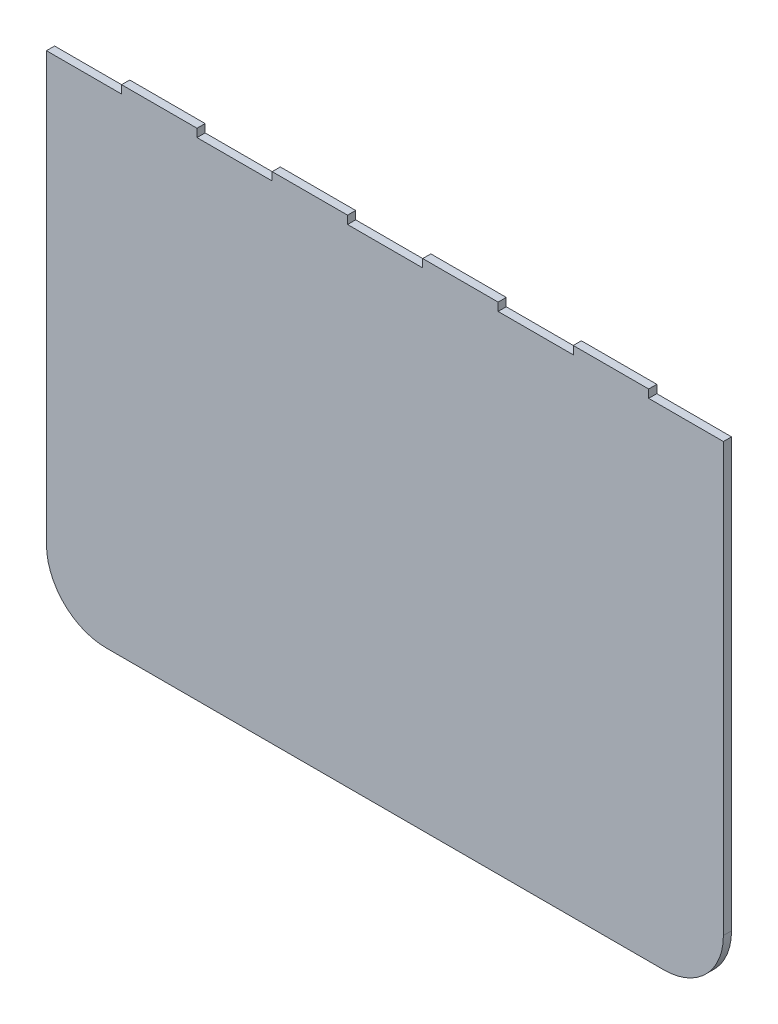
ISO-10303-21;
HEADER;
FILE_DESCRIPTION(('STEP AP214'),'2;1');
FILE_NAME('part.step','',(''),(''),'','','');
FILE_SCHEMA(('AUTOMOTIVE_DESIGN { 1 0 10303 214 1 1 1 1 }'));
ENDSEC;
DATA;
#1=APPLICATION_CONTEXT('core data for automotive mechanical design processes');
#2=APPLICATION_PROTOCOL_DEFINITION('international standard','automotive_design',2000,#1);
#3=PRODUCT_CONTEXT('',#1,'mechanical');
#4=PRODUCT('Part','Part','',(#3));
#5=PRODUCT_RELATED_PRODUCT_CATEGORY('part','',(#4));
#6=PRODUCT_DEFINITION_FORMATION('','',#4);
#7=PRODUCT_DEFINITION_CONTEXT('part definition',#1,'design');
#8=PRODUCT_DEFINITION('design','',#6,#7);
#9=PRODUCT_DEFINITION_SHAPE('','',#8);
#10=(LENGTH_UNIT() NAMED_UNIT(*) SI_UNIT(.MILLI.,.METRE.));
#11=(NAMED_UNIT(*) PLANE_ANGLE_UNIT() SI_UNIT($,.RADIAN.));
#12=(NAMED_UNIT(*) SI_UNIT($,.STERADIAN.) SOLID_ANGLE_UNIT());
#13=UNCERTAINTY_MEASURE_WITH_UNIT(LENGTH_MEASURE(1.E-05),#10,'distance_accuracy_value','');
#14=(GEOMETRIC_REPRESENTATION_CONTEXT(3) GLOBAL_UNCERTAINTY_ASSIGNED_CONTEXT((#13)) GLOBAL_UNIT_ASSIGNED_CONTEXT((#10,
#11,#12)) REPRESENTATION_CONTEXT('',''));
#15=CARTESIAN_POINT('',(0.,0.,0.));
#16=DIRECTION('',(0.,0.,1.));
#17=DIRECTION('',(1.,0.,0.));
#18=AXIS2_PLACEMENT_3D('',#15,#16,#17);
#19=CARTESIAN_POINT('',(0.,366.,-0.00999999999999959));
#20=DIRECTION('',(0.,-1.,0.));
#21=DIRECTION('',(0.,0.,-1.));
#22=AXIS2_PLACEMENT_3D('',#19,#20,#21);
#23=PLANE('',#22);
#24=DIRECTION('',(-1.,0.,0.));
#25=VECTOR('',#24,1.);
#26=CARTESIAN_POINT('',(0.,366.,0.));
#27=LINE('',#26,#25);
#28=CARTESIAN_POINT('',(444.8,366.,0.));
#29=VERTEX_POINT('',#28);
#30=CARTESIAN_POINT('',(389.1,366.,0.));
#31=VERTEX_POINT('',#30);
#32=EDGE_CURVE('E352',#29,#31,#27,.T.);
#33=ORIENTED_EDGE('',*,*,#32,.T.);
#34=DIRECTION('',(0.,0.,-1.));
#35=VECTOR('',#34,1.);
#36=CARTESIAN_POINT('',(389.1,366.,10.));
#37=LINE('',#36,#35);
#38=CARTESIAN_POINT('',(389.1,366.,6.));
#39=VERTEX_POINT('',#38);
#40=EDGE_CURVE('E246',#39,#31,#37,.T.);
#41=ORIENTED_EDGE('',*,*,#40,.F.);
#42=DIRECTION('',(-1.,0.,0.));
#43=VECTOR('',#42,1.);
#44=CARTESIAN_POINT('',(0.,366.,6.));
#45=LINE('',#44,#43);
#46=CARTESIAN_POINT('',(444.8,366.,6.));
#47=VERTEX_POINT('',#46);
#48=EDGE_CURVE('E347',#47,#39,#45,.T.);
#49=ORIENTED_EDGE('',*,*,#48,.F.);
#50=DIRECTION('',(0.,0.,-1.));
#51=VECTOR('',#50,1.);
#52=CARTESIAN_POINT('',(444.8,366.,10.));
#53=LINE('',#52,#51);
#54=EDGE_CURVE('E11',#47,#29,#53,.T.);
#55=ORIENTED_EDGE('',*,*,#54,.T.);
#56=EDGE_LOOP('',(#33,#41,#49,#55));
#57=FACE_BOUND('',#56,.T.);
#58=ADVANCED_FACE('F34',(#57),#23,.F.);
#59=CARTESIAN_POINT('',(333.6,366.,0.));
#60=VERTEX_POINT('',#59);
#61=CARTESIAN_POINT('',(277.9,366.,0.));
#62=VERTEX_POINT('',#61);
#63=EDGE_CURVE('E203',#60,#62,#27,.T.);
#64=ORIENTED_EDGE('',*,*,#63,.T.);
#65=DIRECTION('',(0.,0.,-1.));
#66=VECTOR('',#65,1.);
#67=CARTESIAN_POINT('',(277.9,366.,10.));
#68=LINE('',#67,#66);
#69=CARTESIAN_POINT('',(277.9,366.,6.));
#70=VERTEX_POINT('',#69);
#71=EDGE_CURVE('E231',#70,#62,#68,.T.);
#72=ORIENTED_EDGE('',*,*,#71,.F.);
#73=CARTESIAN_POINT('',(333.6,366.,6.));
#74=VERTEX_POINT('',#73);
#75=EDGE_CURVE('E351',#74,#70,#45,.T.);
#76=ORIENTED_EDGE('',*,*,#75,.F.);
#77=DIRECTION('',(0.,0.,-1.));
#78=VECTOR('',#77,1.);
#79=CARTESIAN_POINT('',(333.6,366.,10.));
#80=LINE('',#79,#78);
#81=EDGE_CURVE('E42',#74,#60,#80,.T.);
#82=ORIENTED_EDGE('',*,*,#81,.T.);
#83=EDGE_LOOP('',(#64,#72,#76,#82));
#84=FACE_BOUND('',#83,.T.);
#85=ADVANCED_FACE('F360',(#84),#23,.F.);
#86=CARTESIAN_POINT('',(111.2,366.,6.));
#87=VERTEX_POINT('',#86);
#88=CARTESIAN_POINT('',(55.4999999999999,366.,6.));
#89=VERTEX_POINT('',#88);
#90=EDGE_CURVE('E344',#87,#89,#45,.T.);
#91=ORIENTED_EDGE('',*,*,#90,.F.);
#92=DIRECTION('',(0.,0.,-1.));
#93=VECTOR('',#92,1.);
#94=CARTESIAN_POINT('',(111.2,366.,10.));
#95=LINE('',#94,#93);
#96=CARTESIAN_POINT('',(111.2,366.,0.));
#97=VERTEX_POINT('',#96);
#98=EDGE_CURVE('E219',#87,#97,#95,.T.);
#99=ORIENTED_EDGE('',*,*,#98,.T.);
#100=CARTESIAN_POINT('',(55.4999999999999,366.,0.));
#101=VERTEX_POINT('',#100);
#102=EDGE_CURVE('E37',#97,#101,#27,.T.);
#103=ORIENTED_EDGE('',*,*,#102,.T.);
#104=DIRECTION('',(0.,0.,-1.));
#105=VECTOR('',#104,1.);
#106=CARTESIAN_POINT('',(55.4999999999999,366.,10.));
#107=LINE('',#106,#105);
#108=EDGE_CURVE('E293',#89,#101,#107,.T.);
#109=ORIENTED_EDGE('',*,*,#108,.F.);
#110=EDGE_LOOP('',(#91,#99,#103,#109));
#111=FACE_BOUND('',#110,.T.);
#112=ADVANCED_FACE('F421',(#111),#23,.F.);
#113=CARTESIAN_POINT('',(222.4,366.,0.));
#114=VERTEX_POINT('',#113);
#115=CARTESIAN_POINT('',(166.7,366.,0.));
#116=VERTEX_POINT('',#115);
#117=EDGE_CURVE('E197',#114,#116,#27,.T.);
#118=ORIENTED_EDGE('',*,*,#117,.T.);
#119=DIRECTION('',(0.,0.,-1.));
#120=VECTOR('',#119,1.);
#121=CARTESIAN_POINT('',(166.7,366.,10.));
#122=LINE('',#121,#120);
#123=CARTESIAN_POINT('',(166.7,366.,6.));
#124=VERTEX_POINT('',#123);
#125=EDGE_CURVE('E182',#124,#116,#122,.T.);
#126=ORIENTED_EDGE('',*,*,#125,.F.);
#127=CARTESIAN_POINT('',(222.4,366.,6.));
#128=VERTEX_POINT('',#127);
#129=EDGE_CURVE('E346',#128,#124,#45,.T.);
#130=ORIENTED_EDGE('',*,*,#129,.F.);
#131=DIRECTION('',(0.,0.,-1.));
#132=VECTOR('',#131,1.);
#133=CARTESIAN_POINT('',(222.4,366.,10.));
#134=LINE('',#133,#132);
#135=EDGE_CURVE('E199',#128,#114,#134,.T.);
#136=ORIENTED_EDGE('',*,*,#135,.T.);
#137=EDGE_LOOP('',(#118,#126,#130,#136));
#138=FACE_BOUND('',#137,.T.);
#139=ADVANCED_FACE('F198',(#138),#23,.F.);
#140=CARTESIAN_POINT('',(0.,0.,6.));
#141=DIRECTION('',(1.,0.,0.));
#142=DIRECTION('',(0.,1.,0.));
#143=AXIS2_PLACEMENT_3D('',#140,#141,#142);
#144=PLANE('',#143);
#145=DIRECTION('',(0.,-1.,0.));
#146=VECTOR('',#145,1.);
#147=CARTESIAN_POINT('',(0.,0.,6.));
#148=LINE('',#147,#146);
#149=CARTESIAN_POINT('',(-1.11022302462516E-13,360.,6.));
#150=VERTEX_POINT('',#149);
#151=CARTESIAN_POINT('',(0.,44.,6.));
#152=VERTEX_POINT('',#151);
#153=EDGE_CURVE('E307',#150,#152,#148,.T.);
#154=ORIENTED_EDGE('',*,*,#153,.F.);
#155=DIRECTION('',(0.,0.,-1.));
#156=VECTOR('',#155,1.);
#157=CARTESIAN_POINT('',(-1.11022302462516E-13,360.,10.));
#158=LINE('',#157,#156);
#159=CARTESIAN_POINT('',(-1.11022302462516E-13,360.,0.));
#160=VERTEX_POINT('',#159);
#161=EDGE_CURVE('E294',#150,#160,#158,.T.);
#162=ORIENTED_EDGE('',*,*,#161,.T.);
#163=DIRECTION('',(0.,-1.,0.));
#164=VECTOR('',#163,1.);
#165=CARTESIAN_POINT('',(0.,0.,0.));
#166=LINE('',#165,#164);
#167=CARTESIAN_POINT('',(0.,44.,0.));
#168=VERTEX_POINT('',#167);
#169=EDGE_CURVE('E306',#160,#168,#166,.T.);
#170=ORIENTED_EDGE('',*,*,#169,.T.);
#171=DIRECTION('',(0.,0.,-1.));
#172=VECTOR('',#171,1.);
#173=CARTESIAN_POINT('',(0.,44.,6.));
#174=LINE('',#173,#172);
#175=EDGE_CURVE('E332',#168,#152,#174,.F.);
#176=ORIENTED_EDGE('',*,*,#175,.T.);
#177=EDGE_LOOP('',(#154,#162,#170,#176));
#178=FACE_BOUND('',#177,.T.);
#179=ADVANCED_FACE('F413',(#178),#144,.F.);
#180=CARTESIAN_POINT('',(44.,44.,6.));
#181=DIRECTION('',(0.,0.,-1.));
#182=DIRECTION('',(-1.,0.,0.));
#183=AXIS2_PLACEMENT_3D('',#180,#181,#182);
#184=CYLINDRICAL_SURFACE('',#183,44.);
#185=CARTESIAN_POINT('',(44.,44.,6.));
#186=DIRECTION('',(0.,0.,-1.));
#187=DIRECTION('',(-1.,0.,0.));
#188=AXIS2_PLACEMENT_3D('',#185,#186,#187);
#189=CIRCLE('',#188,44.);
#190=CARTESIAN_POINT('',(44.,0.,6.));
#191=VERTEX_POINT('',#190);
#192=EDGE_CURVE('E337',#152,#191,#189,.F.);
#193=ORIENTED_EDGE('',*,*,#192,.F.);
#194=ORIENTED_EDGE('',*,*,#175,.F.);
#195=CARTESIAN_POINT('',(44.,44.,0.));
#196=DIRECTION('',(0.,0.,-1.));
#197=DIRECTION('',(-1.,0.,0.));
#198=AXIS2_PLACEMENT_3D('',#195,#196,#197);
#199=CIRCLE('',#198,44.);
#200=CARTESIAN_POINT('',(44.,0.,0.));
#201=VERTEX_POINT('',#200);
#202=EDGE_CURVE('E329',#201,#168,#199,.T.);
#203=ORIENTED_EDGE('',*,*,#202,.F.);
#204=DIRECTION('',(0.,0.,-1.));
#205=VECTOR('',#204,1.);
#206=CARTESIAN_POINT('',(44.,0.,6.));
#207=LINE('',#206,#205);
#208=EDGE_CURVE('E324',#191,#201,#207,.T.);
#209=ORIENTED_EDGE('',*,*,#208,.F.);
#210=EDGE_LOOP('',(#193,#194,#203,#209));
#211=FACE_BOUND('',#210,.T.);
#212=ADVANCED_FACE('F406',(#211),#184,.T.);
#213=CARTESIAN_POINT('',(0.,0.,6.));
#214=DIRECTION('',(0.,1.,0.));
#215=DIRECTION('',(0.,0.,1.));
#216=AXIS2_PLACEMENT_3D('',#213,#214,#215);
#217=PLANE('',#216);
#218=DIRECTION('',(1.,0.,0.));
#219=VECTOR('',#218,1.);
#220=CARTESIAN_POINT('',(0.,0.,6.));
#221=LINE('',#220,#219);
#222=CARTESIAN_POINT('',(456.,0.,6.));
#223=VERTEX_POINT('',#222);
#224=EDGE_CURVE('E309',#191,#223,#221,.T.);
#225=ORIENTED_EDGE('',*,*,#224,.F.);
#226=ORIENTED_EDGE('',*,*,#208,.T.);
#227=DIRECTION('',(1.,0.,0.));
#228=VECTOR('',#227,1.);
#229=CARTESIAN_POINT('',(0.,0.,0.));
#230=LINE('',#229,#228);
#231=CARTESIAN_POINT('',(456.,0.,0.));
#232=VERTEX_POINT('',#231);
#233=EDGE_CURVE('E318',#201,#232,#230,.T.);
#234=ORIENTED_EDGE('',*,*,#233,.T.);
#235=DIRECTION('',(0.,0.,-1.));
#236=VECTOR('',#235,1.);
#237=CARTESIAN_POINT('',(456.,0.,6.));
#238=LINE('',#237,#236);
#239=EDGE_CURVE('E316',#232,#223,#238,.F.);
#240=ORIENTED_EDGE('',*,*,#239,.T.);
#241=EDGE_LOOP('',(#225,#226,#234,#240));
#242=FACE_BOUND('',#241,.T.);
#243=ADVANCED_FACE('F402',(#242),#217,.F.);
#244=CARTESIAN_POINT('',(456.,44.,6.));
#245=DIRECTION('',(0.,0.,-1.));
#246=DIRECTION('',(-1.,0.,0.));
#247=AXIS2_PLACEMENT_3D('',#244,#245,#246);
#248=CYLINDRICAL_SURFACE('',#247,44.);
#249=CARTESIAN_POINT('',(456.,44.,6.));
#250=DIRECTION('',(0.,0.,-1.));
#251=DIRECTION('',(-1.,0.,0.));
#252=AXIS2_PLACEMENT_3D('',#249,#250,#251);
#253=CIRCLE('',#252,44.);
#254=CARTESIAN_POINT('',(500.,44.,6.));
#255=VERTEX_POINT('',#254);
#256=EDGE_CURVE('E335',#223,#255,#253,.F.);
#257=ORIENTED_EDGE('',*,*,#256,.F.);
#258=ORIENTED_EDGE('',*,*,#239,.F.);
#259=CARTESIAN_POINT('',(456.,44.,0.));
#260=DIRECTION('',(0.,0.,-1.));
#261=DIRECTION('',(-1.,0.,0.));
#262=AXIS2_PLACEMENT_3D('',#259,#260,#261);
#263=CIRCLE('',#262,44.);
#264=CARTESIAN_POINT('',(500.,44.,0.));
#265=VERTEX_POINT('',#264);
#266=EDGE_CURVE('E327',#265,#232,#263,.T.);
#267=ORIENTED_EDGE('',*,*,#266,.F.);
#268=DIRECTION('',(0.,0.,-1.));
#269=VECTOR('',#268,1.);
#270=CARTESIAN_POINT('',(500.,44.,6.));
#271=LINE('',#270,#269);
#272=EDGE_CURVE('E339',#255,#265,#271,.T.);
#273=ORIENTED_EDGE('',*,*,#272,.F.);
#274=EDGE_LOOP('',(#257,#258,#267,#273));
#275=FACE_BOUND('',#274,.T.);
#276=ADVANCED_FACE('F397',(#275),#248,.T.);
#277=CARTESIAN_POINT('',(500.,0.,6.));
#278=DIRECTION('',(-1.,0.,0.));
#279=DIRECTION('',(0.,-1.,0.));
#280=AXIS2_PLACEMENT_3D('',#277,#278,#279);
#281=PLANE('',#280);
#282=DIRECTION('',(0.,1.,0.));
#283=VECTOR('',#282,1.);
#284=CARTESIAN_POINT('',(500.,0.,0.));
#285=LINE('',#284,#283);
#286=CARTESIAN_POINT('',(500.,360.,0.));
#287=VERTEX_POINT('',#286);
#288=EDGE_CURVE('E310',#265,#287,#285,.T.);
#289=ORIENTED_EDGE('',*,*,#288,.T.);
#290=DIRECTION('',(0.,0.,1.));
#291=VECTOR('',#290,1.);
#292=CARTESIAN_POINT('',(500.,360.,6.));
#293=LINE('',#292,#291);
#294=CARTESIAN_POINT('',(500.,360.,6.));
#295=VERTEX_POINT('',#294);
#296=EDGE_CURVE('E257',#287,#295,#293,.T.);
#297=ORIENTED_EDGE('',*,*,#296,.T.);
#298=DIRECTION('',(0.,1.,0.));
#299=VECTOR('',#298,1.);
#300=CARTESIAN_POINT('',(500.,0.,6.));
#301=LINE('',#300,#299);
#302=EDGE_CURVE('E313',#255,#295,#301,.T.);
#303=ORIENTED_EDGE('',*,*,#302,.F.);
#304=ORIENTED_EDGE('',*,*,#272,.T.);
#305=EDGE_LOOP('',(#289,#297,#303,#304));
#306=FACE_BOUND('',#305,.T.);
#307=ADVANCED_FACE('F392',(#306),#281,.F.);
#308=CARTESIAN_POINT('',(-1.11022302462516E-13,360.,10.));
#309=DIRECTION('',(0.,-1.,0.));
#310=DIRECTION('',(0.,0.,-1.));
#311=AXIS2_PLACEMENT_3D('',#308,#309,#310);
#312=PLANE('',#311);
#313=DIRECTION('',(0.,0.,-1.));
#314=VECTOR('',#313,1.);
#315=CARTESIAN_POINT('',(55.4999999999999,360.,10.));
#316=LINE('',#315,#314);
#317=CARTESIAN_POINT('',(55.4999999999999,360.,6.));
#318=VERTEX_POINT('',#317);
#319=CARTESIAN_POINT('',(55.4999999999999,360.,0.));
#320=VERTEX_POINT('',#319);
#321=EDGE_CURVE('E298',#318,#320,#316,.T.);
#322=ORIENTED_EDGE('',*,*,#321,.T.);
#323=DIRECTION('',(-1.,0.,0.));
#324=VECTOR('',#323,1.);
#325=CARTESIAN_POINT('',(-1.11022302462516E-13,360.,0.));
#326=LINE('',#325,#324);
#327=EDGE_CURVE('E291',#320,#160,#326,.T.);
#328=ORIENTED_EDGE('',*,*,#327,.T.);
#329=ORIENTED_EDGE('',*,*,#161,.F.);
#330=DIRECTION('',(-1.,0.,0.));
#331=VECTOR('',#330,1.);
#332=CARTESIAN_POINT('',(0.,360.,6.));
#333=LINE('',#332,#331);
#334=EDGE_CURVE('E303',#318,#150,#333,.T.);
#335=ORIENTED_EDGE('',*,*,#334,.F.);
#336=EDGE_LOOP('',(#322,#328,#329,#335));
#337=FACE_BOUND('',#336,.T.);
#338=ADVANCED_FACE('F415',(#337),#312,.F.);
#339=CARTESIAN_POINT('',(333.6,360.,10.));
#340=DIRECTION('',(0.,-1.,0.));
#341=DIRECTION('',(0.,0.,-1.));
#342=AXIS2_PLACEMENT_3D('',#339,#340,#341);
#343=PLANE('',#342);
#344=DIRECTION('',(0.,0.,-1.));
#345=VECTOR('',#344,1.);
#346=CARTESIAN_POINT('',(389.1,360.,10.));
#347=LINE('',#346,#345);
#348=CARTESIAN_POINT('',(389.1,360.,6.));
#349=VERTEX_POINT('',#348);
#350=CARTESIAN_POINT('',(389.1,360.,0.));
#351=VERTEX_POINT('',#350);
#352=EDGE_CURVE('E248',#349,#351,#347,.T.);
#353=ORIENTED_EDGE('',*,*,#352,.T.);
#354=DIRECTION('',(-1.,0.,0.));
#355=VECTOR('',#354,1.);
#356=CARTESIAN_POINT('',(333.6,360.,0.));
#357=LINE('',#356,#355);
#358=CARTESIAN_POINT('',(333.6,360.,0.));
#359=VERTEX_POINT('',#358);
#360=EDGE_CURVE('E243',#351,#359,#357,.T.);
#361=ORIENTED_EDGE('',*,*,#360,.T.);
#362=DIRECTION('',(0.,0.,-1.));
#363=VECTOR('',#362,1.);
#364=CARTESIAN_POINT('',(333.6,360.,10.));
#365=LINE('',#364,#363);
#366=CARTESIAN_POINT('',(333.6,360.,6.));
#367=VERTEX_POINT('',#366);
#368=EDGE_CURVE('E225',#367,#359,#365,.T.);
#369=ORIENTED_EDGE('',*,*,#368,.F.);
#370=DIRECTION('',(-1.,0.,0.));
#371=VECTOR('',#370,1.);
#372=CARTESIAN_POINT('',(0.,360.,6.));
#373=LINE('',#372,#371);
#374=EDGE_CURVE('E266',#349,#367,#373,.T.);
#375=ORIENTED_EDGE('',*,*,#374,.F.);
#376=EDGE_LOOP('',(#353,#361,#369,#375));
#377=FACE_BOUND('',#376,.T.);
#378=ADVANCED_FACE('F377',(#377),#343,.F.);
#379=CARTESIAN_POINT('',(222.4,360.,10.));
#380=DIRECTION('',(0.,-1.,0.));
#381=DIRECTION('',(0.,0.,-1.));
#382=AXIS2_PLACEMENT_3D('',#379,#380,#381);
#383=PLANE('',#382);
#384=DIRECTION('',(0.,0.,-1.));
#385=VECTOR('',#384,1.);
#386=CARTESIAN_POINT('',(277.9,360.,10.));
#387=LINE('',#386,#385);
#388=CARTESIAN_POINT('',(277.9,360.,6.));
#389=VERTEX_POINT('',#388);
#390=CARTESIAN_POINT('',(277.9,360.,0.));
#391=VERTEX_POINT('',#390);
#392=EDGE_CURVE('E233',#389,#391,#387,.T.);
#393=ORIENTED_EDGE('',*,*,#392,.T.);
#394=DIRECTION('',(-1.,0.,0.));
#395=VECTOR('',#394,1.);
#396=CARTESIAN_POINT('',(222.4,360.,0.));
#397=LINE('',#396,#395);
#398=CARTESIAN_POINT('',(222.4,360.,0.));
#399=VERTEX_POINT('',#398);
#400=EDGE_CURVE('E228',#391,#399,#397,.T.);
#401=ORIENTED_EDGE('',*,*,#400,.T.);
#402=DIRECTION('',(0.,0.,-1.));
#403=VECTOR('',#402,1.);
#404=CARTESIAN_POINT('',(222.4,360.,10.));
#405=LINE('',#404,#403);
#406=CARTESIAN_POINT('',(222.4,360.,6.));
#407=VERTEX_POINT('',#406);
#408=EDGE_CURVE('E212',#407,#399,#405,.T.);
#409=ORIENTED_EDGE('',*,*,#408,.F.);
#410=DIRECTION('',(-1.,0.,0.));
#411=VECTOR('',#410,1.);
#412=CARTESIAN_POINT('',(0.,360.,6.));
#413=LINE('',#412,#411);
#414=EDGE_CURVE('E275',#389,#407,#413,.T.);
#415=ORIENTED_EDGE('',*,*,#414,.F.);
#416=EDGE_LOOP('',(#393,#401,#409,#415));
#417=FACE_BOUND('',#416,.T.);
#418=ADVANCED_FACE('F368',(#417),#383,.F.);
#419=CARTESIAN_POINT('',(0.,0.,6.));
#420=DIRECTION('',(0.,0.,-1.));
#421=DIRECTION('',(-1.,0.,0.));
#422=AXIS2_PLACEMENT_3D('',#419,#420,#421);
#423=PLANE('',#422);
#424=DIRECTION('',(0.,1.,0.));
#425=VECTOR('',#424,1.);
#426=CARTESIAN_POINT('',(444.799999999999,-5.14403334742988E-13,6.));
#427=LINE('',#426,#425);
#428=CARTESIAN_POINT('',(444.8,360.,6.));
#429=VERTEX_POINT('',#428);
#430=EDGE_CURVE('E260',#429,#47,#427,.T.);
#431=ORIENTED_EDGE('',*,*,#430,.T.);
#432=ORIENTED_EDGE('',*,*,#48,.T.);
#433=DIRECTION('',(0.,-1.,0.));
#434=VECTOR('',#433,1.);
#435=CARTESIAN_POINT('',(389.1,0.,6.));
#436=LINE('',#435,#434);
#437=EDGE_CURVE('E263',#39,#349,#436,.T.);
#438=ORIENTED_EDGE('',*,*,#437,.T.);
#439=ORIENTED_EDGE('',*,*,#374,.T.);
#440=DIRECTION('',(0.,1.,0.));
#441=VECTOR('',#440,1.);
#442=CARTESIAN_POINT('',(333.6,-3.85802501057241E-13,6.));
#443=LINE('',#442,#441);
#444=EDGE_CURVE('E269',#367,#74,#443,.T.);
#445=ORIENTED_EDGE('',*,*,#444,.T.);
#446=ORIENTED_EDGE('',*,*,#75,.T.);
#447=DIRECTION('',(0.,-1.,0.));
#448=VECTOR('',#447,1.);
#449=CARTESIAN_POINT('',(277.9,0.,6.));
#450=LINE('',#449,#448);
#451=EDGE_CURVE('E272',#70,#389,#450,.T.);
#452=ORIENTED_EDGE('',*,*,#451,.T.);
#453=ORIENTED_EDGE('',*,*,#414,.T.);
#454=DIRECTION('',(0.,1.,0.));
#455=VECTOR('',#454,1.);
#456=CARTESIAN_POINT('',(222.399999999999,-2.57201667371494E-13,6.));
#457=LINE('',#456,#455);
#458=EDGE_CURVE('E278',#407,#128,#457,.T.);
#459=ORIENTED_EDGE('',*,*,#458,.T.);
#460=ORIENTED_EDGE('',*,*,#129,.T.);
#461=DIRECTION('',(0.,-1.,0.));
#462=VECTOR('',#461,1.);
#463=CARTESIAN_POINT('',(166.7,0.,6.));
#464=LINE('',#463,#462);
#465=CARTESIAN_POINT('',(166.7,360.,6.));
#466=VERTEX_POINT('',#465);
#467=EDGE_CURVE('E190',#124,#466,#464,.T.);
#468=ORIENTED_EDGE('',*,*,#467,.T.);
#469=DIRECTION('',(-1.,0.,0.));
#470=VECTOR('',#469,1.);
#471=CARTESIAN_POINT('',(0.,360.,6.));
#472=LINE('',#471,#470);
#473=CARTESIAN_POINT('',(111.2,360.,6.));
#474=VERTEX_POINT('',#473);
#475=EDGE_CURVE('E282',#466,#474,#472,.T.);
#476=ORIENTED_EDGE('',*,*,#475,.T.);
#477=DIRECTION('',(0.,1.,0.));
#478=VECTOR('',#477,1.);
#479=CARTESIAN_POINT('',(111.199999999999,-1.28600833685747E-13,6.));
#480=LINE('',#479,#478);
#481=EDGE_CURVE('E285',#474,#87,#480,.T.);
#482=ORIENTED_EDGE('',*,*,#481,.T.);
#483=ORIENTED_EDGE('',*,*,#90,.T.);
#484=DIRECTION('',(0.,-1.,0.));
#485=VECTOR('',#484,1.);
#486=CARTESIAN_POINT('',(55.4999999999999,0.,6.));
#487=LINE('',#486,#485);
#488=EDGE_CURVE('E297',#89,#318,#487,.T.);
#489=ORIENTED_EDGE('',*,*,#488,.T.);
#490=ORIENTED_EDGE('',*,*,#334,.T.);
#491=ORIENTED_EDGE('',*,*,#153,.T.);
#492=ORIENTED_EDGE('',*,*,#192,.T.);
#493=ORIENTED_EDGE('',*,*,#224,.T.);
#494=ORIENTED_EDGE('',*,*,#256,.T.);
#495=ORIENTED_EDGE('',*,*,#302,.T.);
#496=DIRECTION('',(-1.,0.,0.));
#497=VECTOR('',#496,1.);
#498=CARTESIAN_POINT('',(0.,360.,6.));
#499=LINE('',#498,#497);
#500=EDGE_CURVE('E217',#295,#429,#499,.T.);
#501=ORIENTED_EDGE('',*,*,#500,.T.);
#502=EDGE_LOOP('',(#431,#432,#438,#439,#445,#446,#452,#453,#459,#460,#468,#476,#482,#483,#489,
#490,#491,#492,#493,#494,#495,#501));
#503=FACE_BOUND('',#502,.T.);
#504=ADVANCED_FACE('F356',(#503),#423,.F.);
#505=CARTESIAN_POINT('',(111.2,360.,10.));
#506=DIRECTION('',(0.,-1.,0.));
#507=DIRECTION('',(0.,0.,-1.));
#508=AXIS2_PLACEMENT_3D('',#505,#506,#507);
#509=PLANE('',#508);
#510=DIRECTION('',(0.,0.,-1.));
#511=VECTOR('',#510,1.);
#512=CARTESIAN_POINT('',(166.7,360.,10.));
#513=LINE('',#512,#511);
#514=CARTESIAN_POINT('',(166.7,360.,0.));
#515=VERTEX_POINT('',#514);
#516=EDGE_CURVE('E193',#466,#515,#513,.T.);
#517=ORIENTED_EDGE('',*,*,#516,.T.);
#518=DIRECTION('',(-1.,0.,0.));
#519=VECTOR('',#518,1.);
#520=CARTESIAN_POINT('',(111.2,360.,0.));
#521=LINE('',#520,#519);
#522=CARTESIAN_POINT('',(111.2,360.,0.));
#523=VERTEX_POINT('',#522);
#524=EDGE_CURVE('E194',#515,#523,#521,.T.);
#525=ORIENTED_EDGE('',*,*,#524,.T.);
#526=DIRECTION('',(0.,0.,-1.));
#527=VECTOR('',#526,1.);
#528=CARTESIAN_POINT('',(111.2,360.,10.));
#529=LINE('',#528,#527);
#530=EDGE_CURVE('E215',#474,#523,#529,.T.);
#531=ORIENTED_EDGE('',*,*,#530,.F.);
#532=ORIENTED_EDGE('',*,*,#475,.F.);
#533=EDGE_LOOP('',(#517,#525,#531,#532));
#534=FACE_BOUND('',#533,.T.);
#535=ADVANCED_FACE('F426',(#534),#509,.F.);
#536=CARTESIAN_POINT('',(0.,0.,0.));
#537=DIRECTION('',(0.,0.,-1.));
#538=DIRECTION('',(-1.,0.,0.));
#539=AXIS2_PLACEMENT_3D('',#536,#537,#538);
#540=PLANE('',#539);
#541=ORIENTED_EDGE('',*,*,#32,.F.);
#542=DIRECTION('',(0.,1.,0.));
#543=VECTOR('',#542,1.);
#544=CARTESIAN_POINT('',(444.8,360.,0.));
#545=LINE('',#544,#543);
#546=CARTESIAN_POINT('',(444.8,360.,0.));
#547=VERTEX_POINT('',#546);
#548=EDGE_CURVE('E252',#547,#29,#545,.T.);
#549=ORIENTED_EDGE('',*,*,#548,.F.);
#550=DIRECTION('',(-1.,0.,0.));
#551=VECTOR('',#550,1.);
#552=CARTESIAN_POINT('',(0.,360.,0.));
#553=LINE('',#552,#551);
#554=EDGE_CURVE('E342',#287,#547,#553,.T.);
#555=ORIENTED_EDGE('',*,*,#554,.F.);
#556=ORIENTED_EDGE('',*,*,#288,.F.);
#557=ORIENTED_EDGE('',*,*,#266,.T.);
#558=ORIENTED_EDGE('',*,*,#233,.F.);
#559=ORIENTED_EDGE('',*,*,#202,.T.);
#560=ORIENTED_EDGE('',*,*,#169,.F.);
#561=ORIENTED_EDGE('',*,*,#327,.F.);
#562=DIRECTION('',(0.,-1.,0.));
#563=VECTOR('',#562,1.);
#564=CARTESIAN_POINT('',(55.4999999999999,360.,0.));
#565=LINE('',#564,#563);
#566=EDGE_CURVE('E288',#101,#320,#565,.T.);
#567=ORIENTED_EDGE('',*,*,#566,.F.);
#568=ORIENTED_EDGE('',*,*,#102,.F.);
#569=DIRECTION('',(0.,1.,0.));
#570=VECTOR('',#569,1.);
#571=CARTESIAN_POINT('',(111.2,360.,0.));
#572=LINE('',#571,#570);
#573=EDGE_CURVE('E208',#523,#97,#572,.T.);
#574=ORIENTED_EDGE('',*,*,#573,.F.);
#575=ORIENTED_EDGE('',*,*,#524,.F.);
#576=DIRECTION('',(0.,-1.,0.));
#577=VECTOR('',#576,1.);
#578=CARTESIAN_POINT('',(166.7,360.,0.));
#579=LINE('',#578,#577);
#580=EDGE_CURVE('E187',#116,#515,#579,.T.);
#581=ORIENTED_EDGE('',*,*,#580,.F.);
#582=ORIENTED_EDGE('',*,*,#117,.F.);
#583=DIRECTION('',(0.,1.,0.));
#584=VECTOR('',#583,1.);
#585=CARTESIAN_POINT('',(222.4,360.,0.));
#586=LINE('',#585,#584);
#587=EDGE_CURVE('E222',#399,#114,#586,.T.);
#588=ORIENTED_EDGE('',*,*,#587,.F.);
#589=ORIENTED_EDGE('',*,*,#400,.F.);
#590=DIRECTION('',(0.,-1.,0.));
#591=VECTOR('',#590,1.);
#592=CARTESIAN_POINT('',(277.9,360.,0.));
#593=LINE('',#592,#591);
#594=EDGE_CURVE('E224',#62,#391,#593,.T.);
#595=ORIENTED_EDGE('',*,*,#594,.F.);
#596=ORIENTED_EDGE('',*,*,#63,.F.);
#597=DIRECTION('',(0.,1.,0.));
#598=VECTOR('',#597,1.);
#599=CARTESIAN_POINT('',(333.6,360.,0.));
#600=LINE('',#599,#598);
#601=EDGE_CURVE('E237',#359,#60,#600,.T.);
#602=ORIENTED_EDGE('',*,*,#601,.F.);
#603=ORIENTED_EDGE('',*,*,#360,.F.);
#604=DIRECTION('',(0.,-1.,0.));
#605=VECTOR('',#604,1.);
#606=CARTESIAN_POINT('',(389.1,360.,0.));
#607=LINE('',#606,#605);
#608=EDGE_CURVE('E239',#31,#351,#607,.T.);
#609=ORIENTED_EDGE('',*,*,#608,.F.);
#610=EDGE_LOOP('',(#541,#549,#555,#556,#557,#558,#559,#560,#561,#567,#568,#574,#575,#581,#582,
#588,#589,#595,#596,#602,#603,#609));
#611=FACE_BOUND('',#610,.T.);
#612=ADVANCED_FACE('F205',(#611),#540,.T.);
#613=CARTESIAN_POINT('',(166.7,360.,10.));
#614=DIRECTION('',(1.,0.,0.));
#615=DIRECTION('',(0.,0.,-1.));
#616=AXIS2_PLACEMENT_3D('',#613,#614,#615);
#617=PLANE('',#616);
#618=ORIENTED_EDGE('',*,*,#125,.T.);
#619=ORIENTED_EDGE('',*,*,#580,.T.);
#620=ORIENTED_EDGE('',*,*,#516,.F.);
#621=ORIENTED_EDGE('',*,*,#467,.F.);
#622=EDGE_LOOP('',(#618,#619,#620,#621));
#623=FACE_BOUND('',#622,.T.);
#624=ADVANCED_FACE('F184',(#623),#617,.F.);
#625=CARTESIAN_POINT('',(111.2,360.,10.));
#626=DIRECTION('',(-1.,0.,0.));
#627=DIRECTION('',(0.,-1.,0.));
#628=AXIS2_PLACEMENT_3D('',#625,#626,#627);
#629=PLANE('',#628);
#630=ORIENTED_EDGE('',*,*,#530,.T.);
#631=ORIENTED_EDGE('',*,*,#573,.T.);
#632=ORIENTED_EDGE('',*,*,#98,.F.);
#633=ORIENTED_EDGE('',*,*,#481,.F.);
#634=EDGE_LOOP('',(#630,#631,#632,#633));
#635=FACE_BOUND('',#634,.T.);
#636=ADVANCED_FACE('F423',(#635),#629,.F.);
#637=CARTESIAN_POINT('',(277.9,360.,10.));
#638=DIRECTION('',(1.,0.,0.));
#639=DIRECTION('',(0.,0.,-1.));
#640=AXIS2_PLACEMENT_3D('',#637,#638,#639);
#641=PLANE('',#640);
#642=ORIENTED_EDGE('',*,*,#71,.T.);
#643=ORIENTED_EDGE('',*,*,#594,.T.);
#644=ORIENTED_EDGE('',*,*,#392,.F.);
#645=ORIENTED_EDGE('',*,*,#451,.F.);
#646=EDGE_LOOP('',(#642,#643,#644,#645));
#647=FACE_BOUND('',#646,.T.);
#648=ADVANCED_FACE('F365',(#647),#641,.F.);
#649=CARTESIAN_POINT('',(222.4,360.,10.));
#650=DIRECTION('',(-1.,0.,0.));
#651=DIRECTION('',(0.,-1.,0.));
#652=AXIS2_PLACEMENT_3D('',#649,#650,#651);
#653=PLANE('',#652);
#654=ORIENTED_EDGE('',*,*,#408,.T.);
#655=ORIENTED_EDGE('',*,*,#587,.T.);
#656=ORIENTED_EDGE('',*,*,#135,.F.);
#657=ORIENTED_EDGE('',*,*,#458,.F.);
#658=EDGE_LOOP('',(#654,#655,#656,#657));
#659=FACE_BOUND('',#658,.T.);
#660=ADVANCED_FACE('F371',(#659),#653,.F.);
#661=CARTESIAN_POINT('',(389.1,360.,10.));
#662=DIRECTION('',(1.,0.,0.));
#663=DIRECTION('',(0.,0.,-1.));
#664=AXIS2_PLACEMENT_3D('',#661,#662,#663);
#665=PLANE('',#664);
#666=ORIENTED_EDGE('',*,*,#40,.T.);
#667=ORIENTED_EDGE('',*,*,#608,.T.);
#668=ORIENTED_EDGE('',*,*,#352,.F.);
#669=ORIENTED_EDGE('',*,*,#437,.F.);
#670=EDGE_LOOP('',(#666,#667,#668,#669));
#671=FACE_BOUND('',#670,.T.);
#672=ADVANCED_FACE('F382',(#671),#665,.F.);
#673=CARTESIAN_POINT('',(333.6,360.,10.));
#674=DIRECTION('',(-1.,0.,0.));
#675=DIRECTION('',(0.,-1.,0.));
#676=AXIS2_PLACEMENT_3D('',#673,#674,#675);
#677=PLANE('',#676);
#678=ORIENTED_EDGE('',*,*,#368,.T.);
#679=ORIENTED_EDGE('',*,*,#601,.T.);
#680=ORIENTED_EDGE('',*,*,#81,.F.);
#681=ORIENTED_EDGE('',*,*,#444,.F.);
#682=EDGE_LOOP('',(#678,#679,#680,#681));
#683=FACE_BOUND('',#682,.T.);
#684=ADVANCED_FACE('F374',(#683),#677,.F.);
#685=CARTESIAN_POINT('',(444.8,360.,10.));
#686=DIRECTION('',(0.,-1.,0.));
#687=DIRECTION('',(0.,0.,-1.));
#688=AXIS2_PLACEMENT_3D('',#685,#686,#687);
#689=PLANE('',#688);
#690=ORIENTED_EDGE('',*,*,#554,.T.);
#691=DIRECTION('',(0.,0.,-1.));
#692=VECTOR('',#691,1.);
#693=CARTESIAN_POINT('',(444.8,360.,10.));
#694=LINE('',#693,#692);
#695=EDGE_CURVE('E240',#429,#547,#694,.T.);
#696=ORIENTED_EDGE('',*,*,#695,.F.);
#697=ORIENTED_EDGE('',*,*,#500,.F.);
#698=ORIENTED_EDGE('',*,*,#296,.F.);
#699=EDGE_LOOP('',(#690,#696,#697,#698));
#700=FACE_BOUND('',#699,.T.);
#701=ADVANCED_FACE('F388',(#700),#689,.F.);
#702=CARTESIAN_POINT('',(444.8,360.,10.));
#703=DIRECTION('',(-1.,0.,0.));
#704=DIRECTION('',(0.,-1.,0.));
#705=AXIS2_PLACEMENT_3D('',#702,#703,#704);
#706=PLANE('',#705);
#707=ORIENTED_EDGE('',*,*,#695,.T.);
#708=ORIENTED_EDGE('',*,*,#548,.T.);
#709=ORIENTED_EDGE('',*,*,#54,.F.);
#710=ORIENTED_EDGE('',*,*,#430,.F.);
#711=EDGE_LOOP('',(#707,#708,#709,#710));
#712=FACE_BOUND('',#711,.T.);
#713=ADVANCED_FACE('F386',(#712),#706,.F.);
#714=CARTESIAN_POINT('',(55.4999999999999,360.,10.));
#715=DIRECTION('',(1.,0.,0.));
#716=DIRECTION('',(0.,0.,-1.));
#717=AXIS2_PLACEMENT_3D('',#714,#715,#716);
#718=PLANE('',#717);
#719=ORIENTED_EDGE('',*,*,#108,.T.);
#720=ORIENTED_EDGE('',*,*,#566,.T.);
#721=ORIENTED_EDGE('',*,*,#321,.F.);
#722=ORIENTED_EDGE('',*,*,#488,.F.);
#723=EDGE_LOOP('',(#719,#720,#721,#722));
#724=FACE_BOUND('',#723,.T.);
#725=ADVANCED_FACE('F418',(#724),#718,.F.);
#726=CLOSED_SHELL('',(#58,#85,#112,#139,#179,#212,#243,#276,#307,#338,#378,#418,#504,#535,#612,
#624,#636,#648,#660,#672,#684,#701,#713,#725));
#727=MANIFOLD_SOLID_BREP('B2',#726);
#728=ADVANCED_BREP_SHAPE_REPRESENTATION('',(#18,#727),#14);
#729=SHAPE_DEFINITION_REPRESENTATION(#9,#728);
ENDSEC;
END-ISO-10303-21;
